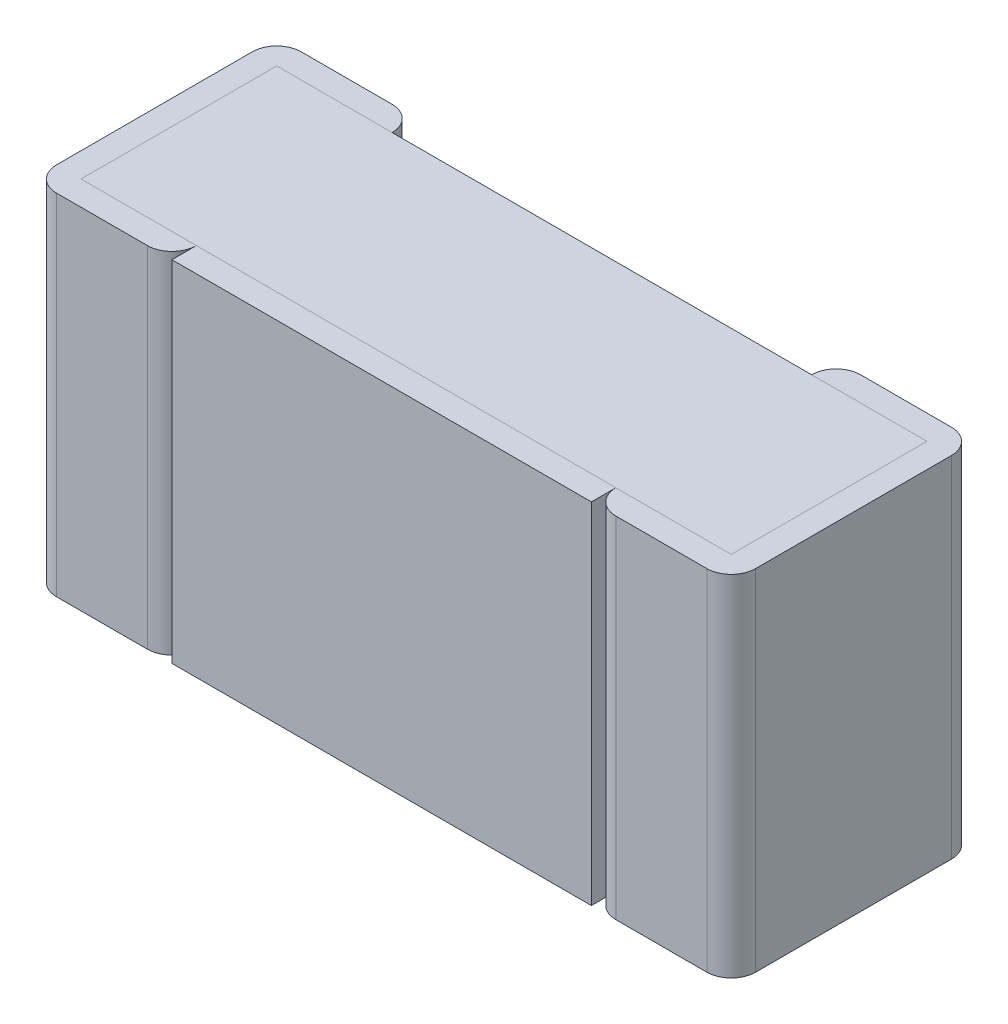
ISO-10303-21;
HEADER;
FILE_DESCRIPTION(('STEP AP214'),'2;1');
FILE_NAME('part.step','',(''),(''),'','','');
FILE_SCHEMA(('AUTOMOTIVE_DESIGN { 1 0 10303 214 1 1 1 1 }'));
ENDSEC;
DATA;
#1=APPLICATION_CONTEXT('core data for automotive mechanical design processes');
#2=APPLICATION_PROTOCOL_DEFINITION('international standard','automotive_design',2000,#1);
#3=PRODUCT_CONTEXT('',#1,'mechanical');
#4=PRODUCT('Part','Part','',(#3));
#5=PRODUCT_RELATED_PRODUCT_CATEGORY('part','',(#4));
#6=PRODUCT_DEFINITION_FORMATION('','',#4);
#7=PRODUCT_DEFINITION_CONTEXT('part definition',#1,'design');
#8=PRODUCT_DEFINITION('design','',#6,#7);
#9=PRODUCT_DEFINITION_SHAPE('','',#8);
#10=(LENGTH_UNIT() NAMED_UNIT(*) SI_UNIT(.MILLI.,.METRE.));
#11=(NAMED_UNIT(*) PLANE_ANGLE_UNIT() SI_UNIT($,.RADIAN.));
#12=(NAMED_UNIT(*) SI_UNIT($,.STERADIAN.) SOLID_ANGLE_UNIT());
#13=UNCERTAINTY_MEASURE_WITH_UNIT(LENGTH_MEASURE(1.E-05),#10,'distance_accuracy_value','');
#14=(GEOMETRIC_REPRESENTATION_CONTEXT(3) GLOBAL_UNCERTAINTY_ASSIGNED_CONTEXT((#13)) GLOBAL_UNIT_ASSIGNED_CONTEXT((#10,
#11,#12)) REPRESENTATION_CONTEXT('',''));
#15=CARTESIAN_POINT('',(0.,0.,0.));
#16=DIRECTION('',(0.,0.,1.));
#17=DIRECTION('',(1.,0.,0.));
#18=AXIS2_PLACEMENT_3D('',#15,#16,#17);
#19=CARTESIAN_POINT('',(-0.5,-0.25,0.));
#20=DIRECTION('',(1.,0.,0.));
#21=DIRECTION('',(0.,0.,1.));
#22=AXIS2_PLACEMENT_3D('',#19,#20,#21);
#23=PLANE('',#22);
#24=DIRECTION('',(0.,1.,0.));
#25=VECTOR('',#24,1.);
#26=CARTESIAN_POINT('',(-0.5,-0.25,0.315));
#27=LINE('',#26,#25);
#28=CARTESIAN_POINT('',(-0.5,-0.25,0.315));
#29=VERTEX_POINT('',#28);
#30=CARTESIAN_POINT('',(-0.5,0.25,0.315));
#31=VERTEX_POINT('',#30);
#32=EDGE_CURVE('E11',#29,#31,#27,.T.);
#33=ORIENTED_EDGE('',*,*,#32,.T.);
#34=DIRECTION('',(0.,0.,1.));
#35=VECTOR('',#34,1.);
#36=CARTESIAN_POINT('',(-0.5,0.25,0.));
#37=LINE('',#36,#35);
#38=CARTESIAN_POINT('',(-0.5,0.25,0.035));
#39=VERTEX_POINT('',#38);
#40=EDGE_CURVE('E25',#39,#31,#37,.T.);
#41=ORIENTED_EDGE('',*,*,#40,.F.);
#42=DIRECTION('',(0.,1.,0.));
#43=VECTOR('',#42,1.);
#44=CARTESIAN_POINT('',(-0.5,-0.25,0.035));
#45=LINE('',#44,#43);
#46=CARTESIAN_POINT('',(-0.5,-0.25,0.035));
#47=VERTEX_POINT('',#46);
#48=EDGE_CURVE('E530',#47,#39,#45,.T.);
#49=ORIENTED_EDGE('',*,*,#48,.F.);
#50=DIRECTION('',(0.,0.,1.));
#51=VECTOR('',#50,1.);
#52=CARTESIAN_POINT('',(-0.5,-0.25,0.));
#53=LINE('',#52,#51);
#54=EDGE_CURVE('E526',#47,#29,#53,.T.);
#55=ORIENTED_EDGE('',*,*,#54,.T.);
#56=EDGE_LOOP('',(#33,#41,#49,#55));
#57=FACE_BOUND('',#56,.T.);
#58=ADVANCED_FACE('F17',(#57),#23,.F.);
#59=CARTESIAN_POINT('',(-0.5,-0.25,0.));
#60=DIRECTION('',(0.,1.,0.));
#61=DIRECTION('',(0.,0.,1.));
#62=AXIS2_PLACEMENT_3D('',#59,#60,#61);
#63=PLANE('',#62);
#64=CARTESIAN_POINT('',(-0.335,-0.25,0.035));
#65=DIRECTION('',(0.,1.,0.));
#66=DIRECTION('',(0.,0.,1.));
#67=AXIS2_PLACEMENT_3D('',#64,#65,#66);
#68=CIRCLE('',#67,0.035);
#69=CARTESIAN_POINT('',(-0.3,-0.25,0.035));
#70=VERTEX_POINT('',#69);
#71=CARTESIAN_POINT('',(-0.335,-0.25,0.));
#72=VERTEX_POINT('',#71);
#73=EDGE_CURVE('E521',#70,#72,#68,.T.);
#74=ORIENTED_EDGE('',*,*,#73,.F.);
#75=DIRECTION('',(1.,0.,0.));
#76=VECTOR('',#75,1.);
#77=CARTESIAN_POINT('',(-0.465,-0.25,0.035));
#78=LINE('',#77,#76);
#79=CARTESIAN_POINT('',(-0.465,-0.25,0.035));
#80=VERTEX_POINT('',#79);
#81=EDGE_CURVE('E516',#80,#70,#78,.T.);
#82=ORIENTED_EDGE('',*,*,#81,.F.);
#83=DIRECTION('',(0.,0.,1.));
#84=VECTOR('',#83,1.);
#85=CARTESIAN_POINT('',(-0.465,-0.25,0.035));
#86=LINE('',#85,#84);
#87=CARTESIAN_POINT('',(-0.465,-0.25,0.315));
#88=VERTEX_POINT('',#87);
#89=EDGE_CURVE('E512',#80,#88,#86,.T.);
#90=ORIENTED_EDGE('',*,*,#89,.T.);
#91=DIRECTION('',(1.,0.,0.));
#92=VECTOR('',#91,1.);
#93=CARTESIAN_POINT('',(-0.465,-0.25,0.315));
#94=LINE('',#93,#92);
#95=CARTESIAN_POINT('',(-0.3,-0.25,0.315));
#96=VERTEX_POINT('',#95);
#97=EDGE_CURVE('E508',#88,#96,#94,.T.);
#98=ORIENTED_EDGE('',*,*,#97,.T.);
#99=CARTESIAN_POINT('',(-0.335,-0.25,0.315));
#100=DIRECTION('',(0.,-1.,0.));
#101=DIRECTION('',(0.,0.,1.));
#102=AXIS2_PLACEMENT_3D('',#99,#100,#101);
#103=CIRCLE('',#102,0.035);
#104=CARTESIAN_POINT('',(-0.335,-0.25,0.35));
#105=VERTEX_POINT('',#104);
#106=EDGE_CURVE('E504',#96,#105,#103,.T.);
#107=ORIENTED_EDGE('',*,*,#106,.T.);
#108=DIRECTION('',(1.,0.,0.));
#109=VECTOR('',#108,1.);
#110=CARTESIAN_POINT('',(-0.5,-0.25,0.35));
#111=LINE('',#110,#109);
#112=CARTESIAN_POINT('',(-0.465,-0.25,0.35));
#113=VERTEX_POINT('',#112);
#114=EDGE_CURVE('E499',#113,#105,#111,.T.);
#115=ORIENTED_EDGE('',*,*,#114,.F.);
#116=CARTESIAN_POINT('',(-0.465,-0.25,0.315));
#117=DIRECTION('',(0.,1.,0.));
#118=DIRECTION('',(0.,0.,1.));
#119=AXIS2_PLACEMENT_3D('',#116,#117,#118);
#120=CIRCLE('',#119,0.035);
#121=EDGE_CURVE('E494',#29,#113,#120,.T.);
#122=ORIENTED_EDGE('',*,*,#121,.F.);
#123=ORIENTED_EDGE('',*,*,#54,.F.);
#124=CARTESIAN_POINT('',(-0.465,-0.25,0.035));
#125=DIRECTION('',(0.,-1.,0.));
#126=DIRECTION('',(0.,0.,1.));
#127=AXIS2_PLACEMENT_3D('',#124,#125,#126);
#128=CIRCLE('',#127,0.035);
#129=CARTESIAN_POINT('',(-0.465,-0.25,0.));
#130=VERTEX_POINT('',#129);
#131=EDGE_CURVE('E490',#47,#130,#128,.T.);
#132=ORIENTED_EDGE('',*,*,#131,.T.);
#133=DIRECTION('',(1.,0.,0.));
#134=VECTOR('',#133,1.);
#135=CARTESIAN_POINT('',(-0.5,-0.25,0.));
#136=LINE('',#135,#134);
#137=EDGE_CURVE('E486',#130,#72,#136,.T.);
#138=ORIENTED_EDGE('',*,*,#137,.T.);
#139=EDGE_LOOP('',(#74,#82,#90,#98,#107,#115,#122,#123,#132,#138));
#140=FACE_BOUND('',#139,.T.);
#141=ADVANCED_FACE('F549',(#140),#63,.F.);
#142=CARTESIAN_POINT('',(-0.5,-0.25,0.));
#143=DIRECTION('',(0.,0.,1.));
#144=DIRECTION('',(1.,0.,0.));
#145=AXIS2_PLACEMENT_3D('',#142,#143,#144);
#146=PLANE('',#145);
#147=DIRECTION('',(0.,1.,0.));
#148=VECTOR('',#147,1.);
#149=CARTESIAN_POINT('',(-0.335,-0.25,0.));
#150=LINE('',#149,#148);
#151=CARTESIAN_POINT('',(-0.335,0.25,0.));
#152=VERTEX_POINT('',#151);
#153=EDGE_CURVE('E481',#72,#152,#150,.T.);
#154=ORIENTED_EDGE('',*,*,#153,.F.);
#155=ORIENTED_EDGE('',*,*,#137,.F.);
#156=DIRECTION('',(0.,1.,0.));
#157=VECTOR('',#156,1.);
#158=CARTESIAN_POINT('',(-0.465,-0.25,0.));
#159=LINE('',#158,#157);
#160=CARTESIAN_POINT('',(-0.465,0.25,0.));
#161=VERTEX_POINT('',#160);
#162=EDGE_CURVE('E477',#130,#161,#159,.T.);
#163=ORIENTED_EDGE('',*,*,#162,.T.);
#164=DIRECTION('',(1.,0.,0.));
#165=VECTOR('',#164,1.);
#166=CARTESIAN_POINT('',(-0.5,0.25,0.));
#167=LINE('',#166,#165);
#168=EDGE_CURVE('E473',#161,#152,#167,.T.);
#169=ORIENTED_EDGE('',*,*,#168,.T.);
#170=EDGE_LOOP('',(#154,#155,#163,#169));
#171=FACE_BOUND('',#170,.T.);
#172=ADVANCED_FACE('F577',(#171),#146,.F.);
#173=CARTESIAN_POINT('',(-0.5,0.25,0.));
#174=DIRECTION('',(0.,1.,0.));
#175=DIRECTION('',(0.,0.,1.));
#176=AXIS2_PLACEMENT_3D('',#173,#174,#175);
#177=PLANE('',#176);
#178=ORIENTED_EDGE('',*,*,#168,.F.);
#179=CARTESIAN_POINT('',(-0.465,0.25,0.035));
#180=DIRECTION('',(0.,-1.,0.));
#181=DIRECTION('',(0.,0.,1.));
#182=AXIS2_PLACEMENT_3D('',#179,#180,#181);
#183=CIRCLE('',#182,0.035);
#184=EDGE_CURVE('E468',#39,#161,#183,.T.);
#185=ORIENTED_EDGE('',*,*,#184,.F.);
#186=ORIENTED_EDGE('',*,*,#40,.T.);
#187=CARTESIAN_POINT('',(-0.465,0.25,0.315));
#188=DIRECTION('',(0.,1.,0.));
#189=DIRECTION('',(0.,0.,1.));
#190=AXIS2_PLACEMENT_3D('',#187,#188,#189);
#191=CIRCLE('',#190,0.035);
#192=CARTESIAN_POINT('',(-0.465,0.25,0.35));
#193=VERTEX_POINT('',#192);
#194=EDGE_CURVE('E464',#31,#193,#191,.T.);
#195=ORIENTED_EDGE('',*,*,#194,.T.);
#196=DIRECTION('',(1.,0.,0.));
#197=VECTOR('',#196,1.);
#198=CARTESIAN_POINT('',(-0.5,0.25,0.35));
#199=LINE('',#198,#197);
#200=CARTESIAN_POINT('',(-0.335,0.25,0.35));
#201=VERTEX_POINT('',#200);
#202=EDGE_CURVE('E460',#193,#201,#199,.T.);
#203=ORIENTED_EDGE('',*,*,#202,.T.);
#204=CARTESIAN_POINT('',(-0.335,0.25,0.315));
#205=DIRECTION('',(0.,-1.,0.));
#206=DIRECTION('',(0.,0.,1.));
#207=AXIS2_PLACEMENT_3D('',#204,#205,#206);
#208=CIRCLE('',#207,0.035);
#209=CARTESIAN_POINT('',(-0.3,0.25,0.315));
#210=VERTEX_POINT('',#209);
#211=EDGE_CURVE('E455',#210,#201,#208,.T.);
#212=ORIENTED_EDGE('',*,*,#211,.F.);
#213=DIRECTION('',(1.,0.,0.));
#214=VECTOR('',#213,1.);
#215=CARTESIAN_POINT('',(-0.465,0.25,0.315));
#216=LINE('',#215,#214);
#217=CARTESIAN_POINT('',(-0.465,0.25,0.315));
#218=VERTEX_POINT('',#217);
#219=EDGE_CURVE('E450',#218,#210,#216,.T.);
#220=ORIENTED_EDGE('',*,*,#219,.F.);
#221=DIRECTION('',(0.,0.,1.));
#222=VECTOR('',#221,1.);
#223=CARTESIAN_POINT('',(-0.465,0.25,0.035));
#224=LINE('',#223,#222);
#225=CARTESIAN_POINT('',(-0.465,0.25,0.035));
#226=VERTEX_POINT('',#225);
#227=EDGE_CURVE('E445',#226,#218,#224,.T.);
#228=ORIENTED_EDGE('',*,*,#227,.F.);
#229=DIRECTION('',(1.,0.,0.));
#230=VECTOR('',#229,1.);
#231=CARTESIAN_POINT('',(-0.465,0.25,0.035));
#232=LINE('',#231,#230);
#233=CARTESIAN_POINT('',(-0.3,0.25,0.035));
#234=VERTEX_POINT('',#233);
#235=EDGE_CURVE('E441',#226,#234,#232,.T.);
#236=ORIENTED_EDGE('',*,*,#235,.T.);
#237=CARTESIAN_POINT('',(-0.335,0.25,0.035));
#238=DIRECTION('',(0.,1.,0.));
#239=DIRECTION('',(0.,0.,1.));
#240=AXIS2_PLACEMENT_3D('',#237,#238,#239);
#241=CIRCLE('',#240,0.035);
#242=EDGE_CURVE('E436',#234,#152,#241,.T.);
#243=ORIENTED_EDGE('',*,*,#242,.T.);
#244=EDGE_LOOP('',(#178,#185,#186,#195,#203,#212,#220,#228,#236,#243));
#245=FACE_BOUND('',#244,.T.);
#246=ADVANCED_FACE('F541',(#245),#177,.T.);
#247=CARTESIAN_POINT('',(-0.335,-0.25,0.035));
#248=DIRECTION('',(0.,1.,0.));
#249=DIRECTION('',(-0.707106781186547,0.,0.707106781186548));
#250=AXIS2_PLACEMENT_3D('',#247,#248,#249);
#251=CYLINDRICAL_SURFACE('',#250,0.035);
#252=ORIENTED_EDGE('',*,*,#73,.T.);
#253=ORIENTED_EDGE('',*,*,#153,.T.);
#254=ORIENTED_EDGE('',*,*,#242,.F.);
#255=DIRECTION('',(0.,1.,0.));
#256=VECTOR('',#255,1.);
#257=CARTESIAN_POINT('',(-0.3,-0.25,0.035));
#258=LINE('',#257,#256);
#259=EDGE_CURVE('E431',#70,#234,#258,.T.);
#260=ORIENTED_EDGE('',*,*,#259,.F.);
#261=EDGE_LOOP('',(#252,#253,#254,#260));
#262=FACE_BOUND('',#261,.T.);
#263=ADVANCED_FACE('F573',(#262),#251,.T.);
#264=CARTESIAN_POINT('',(-0.465,-0.25,0.035));
#265=DIRECTION('',(0.,0.,1.));
#266=DIRECTION('',(1.,0.,0.));
#267=AXIS2_PLACEMENT_3D('',#264,#265,#266);
#268=PLANE('',#267);
#269=DIRECTION('',(1.,0.,0.));
#270=VECTOR('',#269,1.);
#271=CARTESIAN_POINT('',(-0.465,0.25,0.035));
#272=LINE('',#271,#270);
#273=CARTESIAN_POINT('',(0.3,0.25,0.035));
#274=VERTEX_POINT('',#273);
#275=EDGE_CURVE('E427',#234,#274,#272,.T.);
#276=ORIENTED_EDGE('',*,*,#275,.T.);
#277=DIRECTION('',(0.,1.,0.));
#278=VECTOR('',#277,1.);
#279=CARTESIAN_POINT('',(0.3,-0.25,0.035));
#280=LINE('',#279,#278);
#281=CARTESIAN_POINT('',(0.3,-0.25,0.035));
#282=VERTEX_POINT('',#281);
#283=EDGE_CURVE('E423',#282,#274,#280,.T.);
#284=ORIENTED_EDGE('',*,*,#283,.F.);
#285=DIRECTION('',(1.,0.,0.));
#286=VECTOR('',#285,1.);
#287=CARTESIAN_POINT('',(-0.465,-0.25,0.035));
#288=LINE('',#287,#286);
#289=EDGE_CURVE('E419',#70,#282,#288,.T.);
#290=ORIENTED_EDGE('',*,*,#289,.F.);
#291=ORIENTED_EDGE('',*,*,#259,.T.);
#292=EDGE_LOOP('',(#276,#284,#290,#291));
#293=FACE_BOUND('',#292,.T.);
#294=ADVANCED_FACE('F571',(#293),#268,.F.);
#295=CARTESIAN_POINT('',(-0.465,-0.25,0.035));
#296=DIRECTION('',(0.,1.,0.));
#297=DIRECTION('',(0.,0.,1.));
#298=AXIS2_PLACEMENT_3D('',#295,#296,#297);
#299=PLANE('',#298);
#300=ORIENTED_EDGE('',*,*,#289,.T.);
#301=DIRECTION('',(1.,0.,0.));
#302=VECTOR('',#301,1.);
#303=CARTESIAN_POINT('',(-0.465,-0.25,0.035));
#304=LINE('',#303,#302);
#305=CARTESIAN_POINT('',(0.465,-0.25,0.035));
#306=VERTEX_POINT('',#305);
#307=EDGE_CURVE('E170',#282,#306,#304,.T.);
#308=ORIENTED_EDGE('',*,*,#307,.T.);
#309=DIRECTION('',(0.,0.,1.));
#310=VECTOR('',#309,1.);
#311=CARTESIAN_POINT('',(0.465,-0.25,0.035));
#312=LINE('',#311,#310);
#313=CARTESIAN_POINT('',(0.465,-0.25,0.315));
#314=VERTEX_POINT('',#313);
#315=EDGE_CURVE('E412',#306,#314,#312,.T.);
#316=ORIENTED_EDGE('',*,*,#315,.T.);
#317=DIRECTION('',(1.,0.,0.));
#318=VECTOR('',#317,1.);
#319=CARTESIAN_POINT('',(-0.465,-0.25,0.315));
#320=LINE('',#319,#318);
#321=CARTESIAN_POINT('',(0.3,-0.25,0.315));
#322=VERTEX_POINT('',#321);
#323=EDGE_CURVE('E407',#322,#314,#320,.T.);
#324=ORIENTED_EDGE('',*,*,#323,.F.);
#325=DIRECTION('',(1.,0.,0.));
#326=VECTOR('',#325,1.);
#327=CARTESIAN_POINT('',(-0.3,-0.25,0.315));
#328=LINE('',#327,#326);
#329=EDGE_CURVE('E402',#96,#322,#328,.T.);
#330=ORIENTED_EDGE('',*,*,#329,.F.);
#331=ORIENTED_EDGE('',*,*,#97,.F.);
#332=ORIENTED_EDGE('',*,*,#89,.F.);
#333=ORIENTED_EDGE('',*,*,#81,.T.);
#334=EDGE_LOOP('',(#300,#308,#316,#324,#330,#331,#332,#333));
#335=FACE_BOUND('',#334,.T.);
#336=ADVANCED_FACE('F581',(#335),#299,.F.);
#337=CARTESIAN_POINT('',(-0.3,-0.25,0.315));
#338=DIRECTION('',(0.,1.,0.));
#339=DIRECTION('',(0.,0.,1.));
#340=AXIS2_PLACEMENT_3D('',#337,#338,#339);
#341=PLANE('',#340);
#342=DIRECTION('',(0.,0.,1.));
#343=VECTOR('',#342,1.);
#344=CARTESIAN_POINT('',(0.3,-0.25,0.315));
#345=LINE('',#344,#343);
#346=CARTESIAN_POINT('',(0.3,-0.25,0.35));
#347=VERTEX_POINT('',#346);
#348=EDGE_CURVE('E398',#322,#347,#345,.T.);
#349=ORIENTED_EDGE('',*,*,#348,.T.);
#350=DIRECTION('',(1.,0.,0.));
#351=VECTOR('',#350,1.);
#352=CARTESIAN_POINT('',(-0.3,-0.25,0.35));
#353=LINE('',#352,#351);
#354=CARTESIAN_POINT('',(-0.3,-0.25,0.35));
#355=VERTEX_POINT('',#354);
#356=EDGE_CURVE('E393',#355,#347,#353,.T.);
#357=ORIENTED_EDGE('',*,*,#356,.F.);
#358=DIRECTION('',(0.,0.,1.));
#359=VECTOR('',#358,1.);
#360=CARTESIAN_POINT('',(-0.3,-0.25,0.315));
#361=LINE('',#360,#359);
#362=EDGE_CURVE('E389',#96,#355,#361,.T.);
#363=ORIENTED_EDGE('',*,*,#362,.F.);
#364=ORIENTED_EDGE('',*,*,#329,.T.);
#365=EDGE_LOOP('',(#349,#357,#363,#364));
#366=FACE_BOUND('',#365,.T.);
#367=ADVANCED_FACE('F366',(#366),#341,.F.);
#368=CARTESIAN_POINT('',(-0.3,-0.25,0.315));
#369=DIRECTION('',(1.,0.,0.));
#370=DIRECTION('',(0.,0.,1.));
#371=AXIS2_PLACEMENT_3D('',#368,#369,#370);
#372=PLANE('',#371);
#373=DIRECTION('',(0.,1.,0.));
#374=VECTOR('',#373,1.);
#375=CARTESIAN_POINT('',(-0.3,-0.25,0.35));
#376=LINE('',#375,#374);
#377=CARTESIAN_POINT('',(-0.3,0.25,0.35));
#378=VERTEX_POINT('',#377);
#379=EDGE_CURVE('E385',#355,#378,#376,.T.);
#380=ORIENTED_EDGE('',*,*,#379,.T.);
#381=DIRECTION('',(0.,0.,1.));
#382=VECTOR('',#381,1.);
#383=CARTESIAN_POINT('',(-0.3,0.25,0.315));
#384=LINE('',#383,#382);
#385=EDGE_CURVE('E382',#210,#378,#384,.T.);
#386=ORIENTED_EDGE('',*,*,#385,.F.);
#387=CARTESIAN_POINT('',(-0.3,-0.25,0.315));
#388=DIRECTION('',(0.,1.,0.));
#389=VECTOR('',#388,1.);
#390=LINE('',#387,#389);
#391=EDGE_CURVE('E341',#96,#210,#390,.T.);
#392=ORIENTED_EDGE('',*,*,#391,.F.);
#393=ORIENTED_EDGE('',*,*,#362,.T.);
#394=EDGE_LOOP('',(#380,#386,#392,#393));
#395=FACE_BOUND('',#394,.T.);
#396=ADVANCED_FACE('F361',(#395),#372,.F.);
#397=CARTESIAN_POINT('',(-0.335,-0.25,0.315));
#398=DIRECTION('',(0.,1.,0.));
#399=DIRECTION('',(-0.707106781186547,0.,-0.707106781186548));
#400=AXIS2_PLACEMENT_3D('',#397,#398,#399);
#401=CYLINDRICAL_SURFACE('',#400,0.035);
#402=ORIENTED_EDGE('',*,*,#391,.T.);
#403=ORIENTED_EDGE('',*,*,#211,.T.);
#404=DIRECTION('',(0.,1.,0.));
#405=VECTOR('',#404,1.);
#406=CARTESIAN_POINT('',(-0.335,-0.25,0.35));
#407=LINE('',#406,#405);
#408=EDGE_CURVE('E336',#105,#201,#407,.T.);
#409=ORIENTED_EDGE('',*,*,#408,.F.);
#410=ORIENTED_EDGE('',*,*,#106,.F.);
#411=EDGE_LOOP('',(#402,#403,#409,#410));
#412=FACE_BOUND('',#411,.T.);
#413=ADVANCED_FACE('F350',(#412),#401,.T.);
#414=CARTESIAN_POINT('',(-0.5,-0.25,0.35));
#415=DIRECTION('',(0.,0.,1.));
#416=DIRECTION('',(1.,0.,0.));
#417=AXIS2_PLACEMENT_3D('',#414,#415,#416);
#418=PLANE('',#417);
#419=ORIENTED_EDGE('',*,*,#202,.F.);
#420=DIRECTION('',(0.,1.,0.));
#421=VECTOR('',#420,1.);
#422=CARTESIAN_POINT('',(-0.465,-0.25,0.35));
#423=LINE('',#422,#421);
#424=EDGE_CURVE('E331',#113,#193,#423,.T.);
#425=ORIENTED_EDGE('',*,*,#424,.F.);
#426=ORIENTED_EDGE('',*,*,#114,.T.);
#427=ORIENTED_EDGE('',*,*,#408,.T.);
#428=EDGE_LOOP('',(#419,#425,#426,#427));
#429=FACE_BOUND('',#428,.T.);
#430=ADVANCED_FACE('F360',(#429),#418,.T.);
#431=CARTESIAN_POINT('',(-0.465,-0.25,0.315));
#432=DIRECTION('',(0.,1.,0.));
#433=DIRECTION('',(0.707106781186547,0.,-0.707106781186548));
#434=AXIS2_PLACEMENT_3D('',#431,#432,#433);
#435=CYLINDRICAL_SURFACE('',#434,0.035);
#436=ORIENTED_EDGE('',*,*,#121,.T.);
#437=ORIENTED_EDGE('',*,*,#424,.T.);
#438=ORIENTED_EDGE('',*,*,#194,.F.);
#439=ORIENTED_EDGE('',*,*,#32,.F.);
#440=EDGE_LOOP('',(#436,#437,#438,#439));
#441=FACE_BOUND('',#440,.T.);
#442=ADVANCED_FACE('F552',(#441),#435,.T.);
#443=CARTESIAN_POINT('',(-0.3,0.25,0.315));
#444=DIRECTION('',(0.,1.,0.));
#445=DIRECTION('',(0.,0.,1.));
#446=AXIS2_PLACEMENT_3D('',#443,#444,#445);
#447=PLANE('',#446);
#448=DIRECTION('',(1.,0.,0.));
#449=VECTOR('',#448,1.);
#450=CARTESIAN_POINT('',(-0.3,0.25,0.315));
#451=LINE('',#450,#449);
#452=CARTESIAN_POINT('',(0.3,0.25,0.315));
#453=VERTEX_POINT('',#452);
#454=EDGE_CURVE('E326',#210,#453,#451,.T.);
#455=ORIENTED_EDGE('',*,*,#454,.F.);
#456=ORIENTED_EDGE('',*,*,#385,.T.);
#457=DIRECTION('',(1.,0.,0.));
#458=VECTOR('',#457,1.);
#459=CARTESIAN_POINT('',(-0.3,0.25,0.35));
#460=LINE('',#459,#458);
#461=CARTESIAN_POINT('',(0.3,0.25,0.35));
#462=VERTEX_POINT('',#461);
#463=EDGE_CURVE('E322',#378,#462,#460,.T.);
#464=ORIENTED_EDGE('',*,*,#463,.T.);
#465=DIRECTION('',(0.,0.,1.));
#466=VECTOR('',#465,1.);
#467=CARTESIAN_POINT('',(0.3,0.25,0.315));
#468=LINE('',#467,#466);
#469=EDGE_CURVE('E320',#453,#462,#468,.T.);
#470=ORIENTED_EDGE('',*,*,#469,.F.);
#471=EDGE_LOOP('',(#455,#456,#464,#470));
#472=FACE_BOUND('',#471,.T.);
#473=ADVANCED_FACE('F299',(#472),#447,.T.);
#474=CARTESIAN_POINT('',(0.3,-0.25,0.315));
#475=DIRECTION('',(1.,0.,0.));
#476=DIRECTION('',(0.,0.,1.));
#477=AXIS2_PLACEMENT_3D('',#474,#475,#476);
#478=PLANE('',#477);
#479=ORIENTED_EDGE('',*,*,#348,.F.);
#480=CARTESIAN_POINT('',(0.3,-0.25,0.315));
#481=DIRECTION('',(0.,1.,0.));
#482=VECTOR('',#481,1.);
#483=LINE('',#480,#482);
#484=EDGE_CURVE('E318',#322,#453,#483,.T.);
#485=ORIENTED_EDGE('',*,*,#484,.T.);
#486=ORIENTED_EDGE('',*,*,#469,.T.);
#487=DIRECTION('',(0.,1.,0.));
#488=VECTOR('',#487,1.);
#489=CARTESIAN_POINT('',(0.3,-0.25,0.35));
#490=LINE('',#489,#488);
#491=EDGE_CURVE('E587',#347,#462,#490,.T.);
#492=ORIENTED_EDGE('',*,*,#491,.F.);
#493=EDGE_LOOP('',(#479,#485,#486,#492));
#494=FACE_BOUND('',#493,.T.);
#495=ADVANCED_FACE('F294',(#494),#478,.T.);
#496=CARTESIAN_POINT('',(-0.3,-0.25,0.35));
#497=DIRECTION('',(0.,0.,1.));
#498=DIRECTION('',(1.,0.,0.));
#499=AXIS2_PLACEMENT_3D('',#496,#497,#498);
#500=PLANE('',#499);
#501=ORIENTED_EDGE('',*,*,#379,.F.);
#502=ORIENTED_EDGE('',*,*,#356,.T.);
#503=ORIENTED_EDGE('',*,*,#491,.T.);
#504=ORIENTED_EDGE('',*,*,#463,.F.);
#505=EDGE_LOOP('',(#501,#502,#503,#504));
#506=FACE_BOUND('',#505,.T.);
#507=ADVANCED_FACE('F289',(#506),#500,.T.);
#508=CARTESIAN_POINT('',(0.335,-0.25,0.315));
#509=DIRECTION('',(0.,1.,0.));
#510=DIRECTION('',(0.707106781186547,0.,-0.707106781186548));
#511=AXIS2_PLACEMENT_3D('',#508,#509,#510);
#512=CYLINDRICAL_SURFACE('',#511,0.035);
#513=CARTESIAN_POINT('',(0.335,-0.25,0.315));
#514=DIRECTION('',(0.,1.,0.));
#515=DIRECTION('',(0.,0.,1.));
#516=AXIS2_PLACEMENT_3D('',#513,#514,#515);
#517=CIRCLE('',#516,0.035);
#518=CARTESIAN_POINT('',(0.335,-0.25,0.35));
#519=VERTEX_POINT('',#518);
#520=EDGE_CURVE('E588',#322,#519,#517,.T.);
#521=ORIENTED_EDGE('',*,*,#520,.T.);
#522=DIRECTION('',(0.,1.,0.));
#523=VECTOR('',#522,1.);
#524=CARTESIAN_POINT('',(0.335,-0.25,0.35));
#525=LINE('',#524,#523);
#526=CARTESIAN_POINT('',(0.335,0.25,0.35));
#527=VERTEX_POINT('',#526);
#528=EDGE_CURVE('E593',#519,#527,#525,.T.);
#529=ORIENTED_EDGE('',*,*,#528,.T.);
#530=CARTESIAN_POINT('',(0.335,0.25,0.315));
#531=DIRECTION('',(0.,1.,0.));
#532=DIRECTION('',(0.,0.,1.));
#533=AXIS2_PLACEMENT_3D('',#530,#531,#532);
#534=CIRCLE('',#533,0.035);
#535=EDGE_CURVE('E269',#453,#527,#534,.T.);
#536=ORIENTED_EDGE('',*,*,#535,.F.);
#537=ORIENTED_EDGE('',*,*,#484,.F.);
#538=EDGE_LOOP('',(#521,#529,#536,#537));
#539=FACE_BOUND('',#538,.T.);
#540=ADVANCED_FACE('F278',(#539),#512,.T.);
#541=CARTESIAN_POINT('',(0.3,0.25,0.));
#542=DIRECTION('',(0.,1.,0.));
#543=DIRECTION('',(0.,0.,1.));
#544=AXIS2_PLACEMENT_3D('',#541,#542,#543);
#545=PLANE('',#544);
#546=DIRECTION('',(1.,0.,0.));
#547=VECTOR('',#546,1.);
#548=CARTESIAN_POINT('',(0.3,0.25,0.));
#549=LINE('',#548,#547);
#550=CARTESIAN_POINT('',(0.335,0.25,0.));
#551=VERTEX_POINT('',#550);
#552=CARTESIAN_POINT('',(0.465,0.25,0.));
#553=VERTEX_POINT('',#552);
#554=EDGE_CURVE('E265',#551,#553,#549,.T.);
#555=ORIENTED_EDGE('',*,*,#554,.F.);
#556=CARTESIAN_POINT('',(0.335,0.25,0.035));
#557=DIRECTION('',(0.,-1.,0.));
#558=DIRECTION('',(0.,0.,1.));
#559=AXIS2_PLACEMENT_3D('',#556,#557,#558);
#560=CIRCLE('',#559,0.035);
#561=EDGE_CURVE('E188',#274,#551,#560,.T.);
#562=ORIENTED_EDGE('',*,*,#561,.F.);
#563=DIRECTION('',(1.,0.,0.));
#564=VECTOR('',#563,1.);
#565=CARTESIAN_POINT('',(-0.465,0.25,0.035));
#566=LINE('',#565,#564);
#567=CARTESIAN_POINT('',(0.465,0.25,0.035));
#568=VERTEX_POINT('',#567);
#569=EDGE_CURVE('E258',#274,#568,#566,.T.);
#570=ORIENTED_EDGE('',*,*,#569,.T.);
#571=DIRECTION('',(0.,0.,1.));
#572=VECTOR('',#571,1.);
#573=CARTESIAN_POINT('',(0.465,0.25,0.035));
#574=LINE('',#573,#572);
#575=CARTESIAN_POINT('',(0.465,0.25,0.315));
#576=VERTEX_POINT('',#575);
#577=EDGE_CURVE('E254',#568,#576,#574,.T.);
#578=ORIENTED_EDGE('',*,*,#577,.T.);
#579=DIRECTION('',(1.,0.,0.));
#580=VECTOR('',#579,1.);
#581=CARTESIAN_POINT('',(-0.465,0.25,0.315));
#582=LINE('',#581,#580);
#583=EDGE_CURVE('E249',#453,#576,#582,.T.);
#584=ORIENTED_EDGE('',*,*,#583,.F.);
#585=ORIENTED_EDGE('',*,*,#535,.T.);
#586=DIRECTION('',(1.,0.,0.));
#587=VECTOR('',#586,1.);
#588=CARTESIAN_POINT('',(0.3,0.25,0.35));
#589=LINE('',#588,#587);
#590=CARTESIAN_POINT('',(0.465,0.25,0.35));
#591=VERTEX_POINT('',#590);
#592=EDGE_CURVE('E245',#527,#591,#589,.T.);
#593=ORIENTED_EDGE('',*,*,#592,.T.);
#594=CARTESIAN_POINT('',(0.465,0.25,0.315));
#595=DIRECTION('',(0.,-1.,0.));
#596=DIRECTION('',(0.,0.,1.));
#597=AXIS2_PLACEMENT_3D('',#594,#595,#596);
#598=CIRCLE('',#597,0.035);
#599=CARTESIAN_POINT('',(0.5,0.25,0.315));
#600=VERTEX_POINT('',#599);
#601=EDGE_CURVE('E240',#600,#591,#598,.T.);
#602=ORIENTED_EDGE('',*,*,#601,.F.);
#603=DIRECTION('',(0.,0.,1.));
#604=VECTOR('',#603,1.);
#605=CARTESIAN_POINT('',(0.5,0.25,0.));
#606=LINE('',#605,#604);
#607=CARTESIAN_POINT('',(0.5,0.25,0.035));
#608=VERTEX_POINT('',#607);
#609=EDGE_CURVE('E235',#608,#600,#606,.T.);
#610=ORIENTED_EDGE('',*,*,#609,.F.);
#611=CARTESIAN_POINT('',(0.465,0.25,0.035));
#612=DIRECTION('',(0.,1.,0.));
#613=DIRECTION('',(0.,0.,1.));
#614=AXIS2_PLACEMENT_3D('',#611,#612,#613);
#615=CIRCLE('',#614,0.035);
#616=EDGE_CURVE('E231',#608,#553,#615,.T.);
#617=ORIENTED_EDGE('',*,*,#616,.T.);
#618=EDGE_LOOP('',(#555,#562,#570,#578,#584,#585,#593,#602,#610,#617));
#619=FACE_BOUND('',#618,.T.);
#620=ADVANCED_FACE('F288',(#619),#545,.T.);
#621=CARTESIAN_POINT('',(0.465,-0.25,0.035));
#622=DIRECTION('',(0.,1.,0.));
#623=DIRECTION('',(-0.707106781186547,0.,0.707106781186548));
#624=AXIS2_PLACEMENT_3D('',#621,#622,#623);
#625=CYLINDRICAL_SURFACE('',#624,0.035);
#626=CARTESIAN_POINT('',(0.465,-0.25,0.035));
#627=DIRECTION('',(0.,1.,0.));
#628=DIRECTION('',(0.,0.,1.));
#629=AXIS2_PLACEMENT_3D('',#626,#627,#628);
#630=CIRCLE('',#629,0.035);
#631=CARTESIAN_POINT('',(0.5,-0.25,0.035));
#632=VERTEX_POINT('',#631);
#633=CARTESIAN_POINT('',(0.465,-0.25,0.));
#634=VERTEX_POINT('',#633);
#635=EDGE_CURVE('E227',#632,#634,#630,.T.);
#636=ORIENTED_EDGE('',*,*,#635,.T.);
#637=DIRECTION('',(0.,1.,0.));
#638=VECTOR('',#637,1.);
#639=CARTESIAN_POINT('',(0.465,-0.25,0.));
#640=LINE('',#639,#638);
#641=EDGE_CURVE('E184',#634,#553,#640,.T.);
#642=ORIENTED_EDGE('',*,*,#641,.T.);
#643=ORIENTED_EDGE('',*,*,#616,.F.);
#644=DIRECTION('',(0.,1.,0.));
#645=VECTOR('',#644,1.);
#646=CARTESIAN_POINT('',(0.5,-0.25,0.035));
#647=LINE('',#646,#645);
#648=EDGE_CURVE('E219',#632,#608,#647,.T.);
#649=ORIENTED_EDGE('',*,*,#648,.F.);
#650=EDGE_LOOP('',(#636,#642,#643,#649));
#651=FACE_BOUND('',#650,.T.);
#652=ADVANCED_FACE('F606',(#651),#625,.T.);
#653=CARTESIAN_POINT('',(0.5,-0.25,0.));
#654=DIRECTION('',(1.,0.,0.));
#655=DIRECTION('',(0.,0.,1.));
#656=AXIS2_PLACEMENT_3D('',#653,#654,#655);
#657=PLANE('',#656);
#658=DIRECTION('',(0.,0.,1.));
#659=VECTOR('',#658,1.);
#660=CARTESIAN_POINT('',(0.5,-0.25,0.));
#661=LINE('',#660,#659);
#662=CARTESIAN_POINT('',(0.5,-0.25,0.315));
#663=VERTEX_POINT('',#662);
#664=EDGE_CURVE('E214',#632,#663,#661,.T.);
#665=ORIENTED_EDGE('',*,*,#664,.F.);
#666=ORIENTED_EDGE('',*,*,#648,.T.);
#667=ORIENTED_EDGE('',*,*,#609,.T.);
#668=DIRECTION('',(0.,1.,0.));
#669=VECTOR('',#668,1.);
#670=CARTESIAN_POINT('',(0.5,-0.25,0.315));
#671=LINE('',#670,#669);
#672=EDGE_CURVE('E209',#663,#600,#671,.T.);
#673=ORIENTED_EDGE('',*,*,#672,.F.);
#674=EDGE_LOOP('',(#665,#666,#667,#673));
#675=FACE_BOUND('',#674,.T.);
#676=ADVANCED_FACE('F610',(#675),#657,.T.);
#677=CARTESIAN_POINT('',(0.465,-0.25,0.315));
#678=DIRECTION('',(0.,1.,0.));
#679=DIRECTION('',(-0.707106781186547,0.,-0.707106781186548));
#680=AXIS2_PLACEMENT_3D('',#677,#678,#679);
#681=CYLINDRICAL_SURFACE('',#680,0.035);
#682=ORIENTED_EDGE('',*,*,#672,.T.);
#683=ORIENTED_EDGE('',*,*,#601,.T.);
#684=DIRECTION('',(0.,1.,0.));
#685=VECTOR('',#684,1.);
#686=CARTESIAN_POINT('',(0.465,-0.25,0.35));
#687=LINE('',#686,#685);
#688=CARTESIAN_POINT('',(0.465,-0.25,0.35));
#689=VERTEX_POINT('',#688);
#690=EDGE_CURVE('E204',#689,#591,#687,.T.);
#691=ORIENTED_EDGE('',*,*,#690,.F.);
#692=CARTESIAN_POINT('',(0.465,-0.25,0.315));
#693=DIRECTION('',(0.,-1.,0.));
#694=DIRECTION('',(0.,0.,1.));
#695=AXIS2_PLACEMENT_3D('',#692,#693,#694);
#696=CIRCLE('',#695,0.035);
#697=EDGE_CURVE('E199',#663,#689,#696,.T.);
#698=ORIENTED_EDGE('',*,*,#697,.F.);
#699=EDGE_LOOP('',(#682,#683,#691,#698));
#700=FACE_BOUND('',#699,.T.);
#701=ADVANCED_FACE('F612',(#700),#681,.T.);
#702=CARTESIAN_POINT('',(0.3,-0.25,0.));
#703=DIRECTION('',(0.,1.,0.));
#704=DIRECTION('',(0.,0.,1.));
#705=AXIS2_PLACEMENT_3D('',#702,#703,#704);
#706=PLANE('',#705);
#707=ORIENTED_EDGE('',*,*,#635,.F.);
#708=ORIENTED_EDGE('',*,*,#664,.T.);
#709=ORIENTED_EDGE('',*,*,#697,.T.);
#710=DIRECTION('',(1.,0.,0.));
#711=VECTOR('',#710,1.);
#712=CARTESIAN_POINT('',(0.3,-0.25,0.35));
#713=LINE('',#712,#711);
#714=EDGE_CURVE('E175',#519,#689,#713,.T.);
#715=ORIENTED_EDGE('',*,*,#714,.F.);
#716=ORIENTED_EDGE('',*,*,#520,.F.);
#717=ORIENTED_EDGE('',*,*,#323,.T.);
#718=ORIENTED_EDGE('',*,*,#315,.F.);
#719=ORIENTED_EDGE('',*,*,#307,.F.);
#720=CARTESIAN_POINT('',(0.335,-0.25,0.035));
#721=DIRECTION('',(0.,-1.,0.));
#722=DIRECTION('',(0.,0.,1.));
#723=AXIS2_PLACEMENT_3D('',#720,#721,#722);
#724=CIRCLE('',#723,0.035);
#725=CARTESIAN_POINT('',(0.335,-0.25,0.));
#726=VERTEX_POINT('',#725);
#727=EDGE_CURVE('E163',#282,#726,#724,.T.);
#728=ORIENTED_EDGE('',*,*,#727,.T.);
#729=DIRECTION('',(1.,0.,0.));
#730=VECTOR('',#729,1.);
#731=CARTESIAN_POINT('',(0.3,-0.25,0.));
#732=LINE('',#731,#730);
#733=EDGE_CURVE('E167',#726,#634,#732,.T.);
#734=ORIENTED_EDGE('',*,*,#733,.T.);
#735=EDGE_LOOP('',(#707,#708,#709,#715,#716,#717,#718,#719,#728,#734));
#736=FACE_BOUND('',#735,.T.);
#737=ADVANCED_FACE('F166',(#736),#706,.F.);
#738=CARTESIAN_POINT('',(0.3,-0.25,0.));
#739=DIRECTION('',(0.,0.,1.));
#740=DIRECTION('',(1.,0.,0.));
#741=AXIS2_PLACEMENT_3D('',#738,#739,#740);
#742=PLANE('',#741);
#743=ORIENTED_EDGE('',*,*,#641,.F.);
#744=ORIENTED_EDGE('',*,*,#733,.F.);
#745=DIRECTION('',(0.,1.,0.));
#746=VECTOR('',#745,1.);
#747=CARTESIAN_POINT('',(0.335,-0.25,0.));
#748=LINE('',#747,#746);
#749=EDGE_CURVE('E181',#726,#551,#748,.T.);
#750=ORIENTED_EDGE('',*,*,#749,.T.);
#751=ORIENTED_EDGE('',*,*,#554,.T.);
#752=EDGE_LOOP('',(#743,#744,#750,#751));
#753=FACE_BOUND('',#752,.T.);
#754=ADVANCED_FACE('F179',(#753),#742,.F.);
#755=CARTESIAN_POINT('',(0.335,-0.25,0.035));
#756=DIRECTION('',(0.,1.,0.));
#757=DIRECTION('',(0.707106781186547,0.,0.707106781186548));
#758=AXIS2_PLACEMENT_3D('',#755,#756,#757);
#759=CYLINDRICAL_SURFACE('',#758,0.035);
#760=ORIENTED_EDGE('',*,*,#283,.T.);
#761=ORIENTED_EDGE('',*,*,#561,.T.);
#762=ORIENTED_EDGE('',*,*,#749,.F.);
#763=ORIENTED_EDGE('',*,*,#727,.F.);
#764=EDGE_LOOP('',(#760,#761,#762,#763));
#765=FACE_BOUND('',#764,.T.);
#766=ADVANCED_FACE('F186',(#765),#759,.T.);
#767=CARTESIAN_POINT('',(0.3,-0.25,0.35));
#768=DIRECTION('',(0.,0.,1.));
#769=DIRECTION('',(1.,0.,0.));
#770=AXIS2_PLACEMENT_3D('',#767,#768,#769);
#771=PLANE('',#770);
#772=ORIENTED_EDGE('',*,*,#592,.F.);
#773=ORIENTED_EDGE('',*,*,#528,.F.);
#774=ORIENTED_EDGE('',*,*,#714,.T.);
#775=ORIENTED_EDGE('',*,*,#690,.T.);
#776=EDGE_LOOP('',(#772,#773,#774,#775));
#777=FACE_BOUND('',#776,.T.);
#778=ADVANCED_FACE('F614',(#777),#771,.T.);
#779=CARTESIAN_POINT('',(-0.465,0.25,0.035));
#780=DIRECTION('',(0.,1.,0.));
#781=DIRECTION('',(0.,0.,1.));
#782=AXIS2_PLACEMENT_3D('',#779,#780,#781);
#783=PLANE('',#782);
#784=ORIENTED_EDGE('',*,*,#235,.F.);
#785=ORIENTED_EDGE('',*,*,#227,.T.);
#786=ORIENTED_EDGE('',*,*,#219,.T.);
#787=ORIENTED_EDGE('',*,*,#454,.T.);
#788=ORIENTED_EDGE('',*,*,#583,.T.);
#789=ORIENTED_EDGE('',*,*,#577,.F.);
#790=ORIENTED_EDGE('',*,*,#569,.F.);
#791=ORIENTED_EDGE('',*,*,#275,.F.);
#792=EDGE_LOOP('',(#784,#785,#786,#787,#788,#789,#790,#791));
#793=FACE_BOUND('',#792,.T.);
#794=ADVANCED_FACE('F563',(#793),#783,.T.);
#795=CARTESIAN_POINT('',(-0.465,-0.25,0.035));
#796=DIRECTION('',(0.,1.,0.));
#797=DIRECTION('',(0.707106781186547,0.,0.707106781186548));
#798=AXIS2_PLACEMENT_3D('',#795,#796,#797);
#799=CYLINDRICAL_SURFACE('',#798,0.035);
#800=ORIENTED_EDGE('',*,*,#48,.T.);
#801=ORIENTED_EDGE('',*,*,#184,.T.);
#802=ORIENTED_EDGE('',*,*,#162,.F.);
#803=ORIENTED_EDGE('',*,*,#131,.F.);
#804=EDGE_LOOP('',(#800,#801,#802,#803));
#805=FACE_BOUND('',#804,.T.);
#806=ADVANCED_FACE('F545',(#805),#799,.T.);
#807=CLOSED_SHELL('',(#58,#141,#172,#246,#263,#294,#336,#367,#396,#413,#430,#442,#473,#495,#507,
#540,#620,#652,#676,#701,#737,#754,#766,#778,#794,#806));
#808=MANIFOLD_SOLID_BREP('B1',#807);
#809=ADVANCED_BREP_SHAPE_REPRESENTATION('',(#18,#808),#14);
#810=SHAPE_DEFINITION_REPRESENTATION(#9,#809);
ENDSEC;
END-ISO-10303-21;
